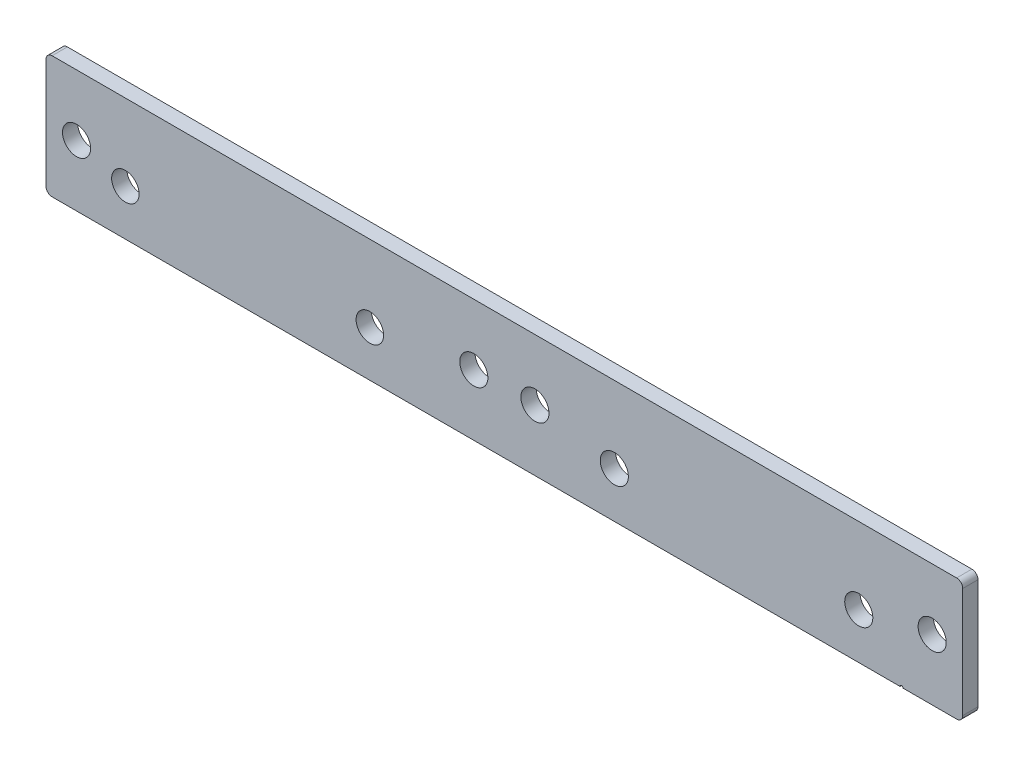
ISO-10303-21;
HEADER;
FILE_DESCRIPTION(('STEP AP214'),'2;1');
FILE_NAME('part.step','',(''),(''),'','','');
FILE_SCHEMA(('AUTOMOTIVE_DESIGN { 1 0 10303 214 1 1 1 1 }'));
ENDSEC;
DATA;
#1=APPLICATION_CONTEXT('core data for automotive mechanical design processes');
#2=APPLICATION_PROTOCOL_DEFINITION('international standard','automotive_design',2000,#1);
#3=PRODUCT_CONTEXT('',#1,'mechanical');
#4=PRODUCT('Part','Part','',(#3));
#5=PRODUCT_RELATED_PRODUCT_CATEGORY('part','',(#4));
#6=PRODUCT_DEFINITION_FORMATION('','',#4);
#7=PRODUCT_DEFINITION_CONTEXT('part definition',#1,'design');
#8=PRODUCT_DEFINITION('design','',#6,#7);
#9=PRODUCT_DEFINITION_SHAPE('','',#8);
#10=(LENGTH_UNIT() NAMED_UNIT(*) SI_UNIT(.MILLI.,.METRE.));
#11=(NAMED_UNIT(*) PLANE_ANGLE_UNIT() SI_UNIT($,.RADIAN.));
#12=(NAMED_UNIT(*) SI_UNIT($,.STERADIAN.) SOLID_ANGLE_UNIT());
#13=UNCERTAINTY_MEASURE_WITH_UNIT(LENGTH_MEASURE(1.E-05),#10,'distance_accuracy_value','');
#14=(GEOMETRIC_REPRESENTATION_CONTEXT(3) GLOBAL_UNCERTAINTY_ASSIGNED_CONTEXT((#13)) GLOBAL_UNIT_ASSIGNED_CONTEXT((#10,
#11,#12)) REPRESENTATION_CONTEXT('',''));
#15=CARTESIAN_POINT('',(0.,0.,0.));
#16=DIRECTION('',(0.,0.,1.));
#17=DIRECTION('',(1.,0.,0.));
#18=AXIS2_PLACEMENT_3D('',#15,#16,#17);
#19=CARTESIAN_POINT('',(-150.,-20.,5.));
#20=DIRECTION('',(0.,1.,0.));
#21=DIRECTION('',(-1.,0.,0.));
#22=AXIS2_PLACEMENT_3D('',#19,#20,#21);
#23=PLANE('',#22);
#24=DIRECTION('',(1.,0.,0.));
#25=VECTOR('',#24,1.);
#26=CARTESIAN_POINT('',(-150.,-20.,5.));
#27=LINE('',#26,#25);
#28=CARTESIAN_POINT('',(130.500000001088,-19.9999999999999,5.));
#29=VERTEX_POINT('',#28);
#30=CARTESIAN_POINT('',(148.,-19.9999999999999,5.));
#31=VERTEX_POINT('',#30);
#32=EDGE_CURVE('E117',#29,#31,#27,.T.);
#33=ORIENTED_EDGE('',*,*,#32,.F.);
#34=DIRECTION('',(0.,0.,-1.));
#35=VECTOR('',#34,1.);
#36=CARTESIAN_POINT('',(130.500000001088,-19.9999999999999,5.));
#37=LINE('',#36,#35);
#38=CARTESIAN_POINT('',(130.500000001088,-19.9999999999999,0.));
#39=VERTEX_POINT('',#38);
#40=EDGE_CURVE('E95',#29,#39,#37,.T.);
#41=ORIENTED_EDGE('',*,*,#40,.T.);
#42=DIRECTION('',(1.,0.,0.));
#43=VECTOR('',#42,1.);
#44=CARTESIAN_POINT('',(-150.,-20.,0.));
#45=LINE('',#44,#43);
#46=CARTESIAN_POINT('',(148.,-19.9999999999999,0.));
#47=VERTEX_POINT('',#46);
#48=EDGE_CURVE('E131',#39,#47,#45,.T.);
#49=ORIENTED_EDGE('',*,*,#48,.T.);
#50=DIRECTION('',(0.,0.,-1.));
#51=VECTOR('',#50,1.);
#52=CARTESIAN_POINT('',(148.,-19.9999999999999,5.));
#53=LINE('',#52,#51);
#54=EDGE_CURVE('E154',#47,#31,#53,.F.);
#55=ORIENTED_EDGE('',*,*,#54,.T.);
#56=EDGE_LOOP('',(#33,#41,#49,#55));
#57=FACE_BOUND('',#56,.T.);
#58=ADVANCED_FACE('F16',(#57),#23,.F.);
#59=CARTESIAN_POINT('',(-150.,20.,5.));
#60=DIRECTION('',(1.,0.,0.));
#61=DIRECTION('',(0.,1.,0.));
#62=AXIS2_PLACEMENT_3D('',#59,#60,#61);
#63=PLANE('',#62);
#64=DIRECTION('',(0.,-1.,0.));
#65=VECTOR('',#64,1.);
#66=CARTESIAN_POINT('',(-150.,20.,0.));
#67=LINE('',#66,#65);
#68=CARTESIAN_POINT('',(-150.,18.,0.));
#69=VERTEX_POINT('',#68);
#70=CARTESIAN_POINT('',(-150.,-18.,0.));
#71=VERTEX_POINT('',#70);
#72=EDGE_CURVE('E128',#69,#71,#67,.T.);
#73=ORIENTED_EDGE('',*,*,#72,.T.);
#74=DIRECTION('',(0.,0.,-1.));
#75=VECTOR('',#74,1.);
#76=CARTESIAN_POINT('',(-150.,-18.,5.));
#77=LINE('',#76,#75);
#78=CARTESIAN_POINT('',(-150.,-18.,5.));
#79=VERTEX_POINT('',#78);
#80=EDGE_CURVE('E10',#71,#79,#77,.F.);
#81=ORIENTED_EDGE('',*,*,#80,.T.);
#82=DIRECTION('',(0.,-1.,0.));
#83=VECTOR('',#82,1.);
#84=CARTESIAN_POINT('',(-150.,20.,5.));
#85=LINE('',#84,#83);
#86=CARTESIAN_POINT('',(-150.,18.,5.));
#87=VERTEX_POINT('',#86);
#88=EDGE_CURVE('E122',#87,#79,#85,.T.);
#89=ORIENTED_EDGE('',*,*,#88,.F.);
#90=DIRECTION('',(0.,0.,-1.));
#91=VECTOR('',#90,1.);
#92=CARTESIAN_POINT('',(-150.,18.,5.));
#93=LINE('',#92,#91);
#94=EDGE_CURVE('E24',#87,#69,#93,.T.);
#95=ORIENTED_EDGE('',*,*,#94,.T.);
#96=EDGE_LOOP('',(#73,#81,#89,#95));
#97=FACE_BOUND('',#96,.T.);
#98=ADVANCED_FACE('F172',(#97),#63,.F.);
#99=CARTESIAN_POINT('',(-148.,-20.,0.));
#100=VERTEX_POINT('',#99);
#101=CARTESIAN_POINT('',(129.500000001088,-19.9999999999999,0.));
#102=VERTEX_POINT('',#101);
#103=EDGE_CURVE('E109',#100,#102,#45,.T.);
#104=ORIENTED_EDGE('',*,*,#103,.T.);
#105=DIRECTION('',(0.,0.,-1.));
#106=VECTOR('',#105,1.);
#107=CARTESIAN_POINT('',(129.500000001088,-19.9999999999999,5.));
#108=LINE('',#107,#106);
#109=CARTESIAN_POINT('',(129.500000001088,-19.9999999999999,5.));
#110=VERTEX_POINT('',#109);
#111=EDGE_CURVE('E31',#102,#110,#108,.F.);
#112=ORIENTED_EDGE('',*,*,#111,.T.);
#113=CARTESIAN_POINT('',(-148.,-20.,5.));
#114=VERTEX_POINT('',#113);
#115=EDGE_CURVE('E106',#114,#110,#27,.T.);
#116=ORIENTED_EDGE('',*,*,#115,.F.);
#117=DIRECTION('',(0.,0.,-1.));
#118=VECTOR('',#117,1.);
#119=CARTESIAN_POINT('',(-148.,-20.,5.));
#120=LINE('',#119,#118);
#121=EDGE_CURVE('E152',#114,#100,#120,.T.);
#122=ORIENTED_EDGE('',*,*,#121,.T.);
#123=EDGE_LOOP('',(#104,#112,#116,#122));
#124=FACE_BOUND('',#123,.T.);
#125=ADVANCED_FACE('F104',(#124),#23,.F.);
#126=CARTESIAN_POINT('',(150.,20.,5.));
#127=DIRECTION('',(-1.,0.,0.));
#128=DIRECTION('',(0.,0.,1.));
#129=AXIS2_PLACEMENT_3D('',#126,#127,#128);
#130=PLANE('',#129);
#131=DIRECTION('',(0.,1.,0.));
#132=VECTOR('',#131,1.);
#133=CARTESIAN_POINT('',(150.,20.,5.));
#134=LINE('',#133,#132);
#135=CARTESIAN_POINT('',(150.,-17.9999999999999,5.));
#136=VERTEX_POINT('',#135);
#137=CARTESIAN_POINT('',(150.,18.,5.));
#138=VERTEX_POINT('',#137);
#139=EDGE_CURVE('E116',#136,#138,#134,.T.);
#140=ORIENTED_EDGE('',*,*,#139,.F.);
#141=DIRECTION('',(0.,0.,-1.));
#142=VECTOR('',#141,1.);
#143=CARTESIAN_POINT('',(150.,-17.9999999999999,5.));
#144=LINE('',#143,#142);
#145=CARTESIAN_POINT('',(150.,-17.9999999999999,0.));
#146=VERTEX_POINT('',#145);
#147=EDGE_CURVE('E140',#136,#146,#144,.T.);
#148=ORIENTED_EDGE('',*,*,#147,.T.);
#149=DIRECTION('',(0.,1.,0.));
#150=VECTOR('',#149,1.);
#151=CARTESIAN_POINT('',(150.,20.,0.));
#152=LINE('',#151,#150);
#153=CARTESIAN_POINT('',(150.,18.,0.));
#154=VERTEX_POINT('',#153);
#155=EDGE_CURVE('E134',#146,#154,#152,.T.);
#156=ORIENTED_EDGE('',*,*,#155,.T.);
#157=DIRECTION('',(0.,0.,-1.));
#158=VECTOR('',#157,1.);
#159=CARTESIAN_POINT('',(150.,18.,5.));
#160=LINE('',#159,#158);
#161=EDGE_CURVE('E127',#154,#138,#160,.F.);
#162=ORIENTED_EDGE('',*,*,#161,.T.);
#163=EDGE_LOOP('',(#140,#148,#156,#162));
#164=FACE_BOUND('',#163,.T.);
#165=ADVANCED_FACE('F202',(#164),#130,.F.);
#166=CARTESIAN_POINT('',(-150.,20.,5.));
#167=DIRECTION('',(0.,-1.,0.));
#168=DIRECTION('',(1.,0.,0.));
#169=AXIS2_PLACEMENT_3D('',#166,#167,#168);
#170=PLANE('',#169);
#171=DIRECTION('',(-1.,0.,0.));
#172=VECTOR('',#171,1.);
#173=CARTESIAN_POINT('',(-150.,20.,5.));
#174=LINE('',#173,#172);
#175=CARTESIAN_POINT('',(148.,20.,5.));
#176=VERTEX_POINT('',#175);
#177=CARTESIAN_POINT('',(-148.,20.,5.));
#178=VERTEX_POINT('',#177);
#179=EDGE_CURVE('E120',#176,#178,#174,.T.);
#180=ORIENTED_EDGE('',*,*,#179,.F.);
#181=DIRECTION('',(0.,0.,-1.));
#182=VECTOR('',#181,1.);
#183=CARTESIAN_POINT('',(148.,20.,5.));
#184=LINE('',#183,#182);
#185=CARTESIAN_POINT('',(148.,20.,0.));
#186=VERTEX_POINT('',#185);
#187=EDGE_CURVE('E165',#176,#186,#184,.T.);
#188=ORIENTED_EDGE('',*,*,#187,.T.);
#189=DIRECTION('',(-1.,0.,0.));
#190=VECTOR('',#189,1.);
#191=CARTESIAN_POINT('',(-150.,20.,0.));
#192=LINE('',#191,#190);
#193=CARTESIAN_POINT('',(-148.,20.,0.));
#194=VERTEX_POINT('',#193);
#195=EDGE_CURVE('E137',#186,#194,#192,.T.);
#196=ORIENTED_EDGE('',*,*,#195,.T.);
#197=DIRECTION('',(0.,0.,-1.));
#198=VECTOR('',#197,1.);
#199=CARTESIAN_POINT('',(-148.,20.,5.));
#200=LINE('',#199,#198);
#201=EDGE_CURVE('E39',#194,#178,#200,.F.);
#202=ORIENTED_EDGE('',*,*,#201,.T.);
#203=EDGE_LOOP('',(#180,#188,#196,#202));
#204=FACE_BOUND('',#203,.T.);
#205=ADVANCED_FACE('F206',(#204),#170,.F.);
#206=CARTESIAN_POINT('',(0.,0.,5.));
#207=DIRECTION('',(0.,0.,1.));
#208=DIRECTION('',(1.,0.,0.));
#209=AXIS2_PLACEMENT_3D('',#206,#207,#208);
#210=PLANE('',#209);
#211=CARTESIAN_POINT('',(130.000000001088,-20.,5.));
#212=DIRECTION('',(0.,0.,-1.));
#213=DIRECTION('',(-1.,0.,0.));
#214=AXIS2_PLACEMENT_3D('',#211,#212,#213);
#215=CIRCLE('',#214,0.499999999999999);
#216=EDGE_CURVE('E92',#110,#29,#215,.T.);
#217=ORIENTED_EDGE('',*,*,#216,.T.);
#218=ORIENTED_EDGE('',*,*,#32,.T.);
#219=CARTESIAN_POINT('',(148.,-17.9999999999999,5.));
#220=DIRECTION('',(0.,0.,1.));
#221=DIRECTION('',(1.,0.,0.));
#222=AXIS2_PLACEMENT_3D('',#219,#220,#221);
#223=CIRCLE('',#222,2.);
#224=EDGE_CURVE('E162',#31,#136,#223,.T.);
#225=ORIENTED_EDGE('',*,*,#224,.T.);
#226=ORIENTED_EDGE('',*,*,#139,.T.);
#227=CARTESIAN_POINT('',(148.,18.,5.));
#228=DIRECTION('',(0.,0.,1.));
#229=DIRECTION('',(1.,0.,0.));
#230=AXIS2_PLACEMENT_3D('',#227,#228,#229);
#231=CIRCLE('',#230,2.);
#232=EDGE_CURVE('E160',#138,#176,#231,.T.);
#233=ORIENTED_EDGE('',*,*,#232,.T.);
#234=ORIENTED_EDGE('',*,*,#179,.T.);
#235=CARTESIAN_POINT('',(-148.,18.,5.));
#236=DIRECTION('',(0.,0.,1.));
#237=DIRECTION('',(1.,0.,0.));
#238=AXIS2_PLACEMENT_3D('',#235,#236,#237);
#239=CIRCLE('',#238,2.);
#240=EDGE_CURVE('E157',#178,#87,#239,.T.);
#241=ORIENTED_EDGE('',*,*,#240,.T.);
#242=ORIENTED_EDGE('',*,*,#88,.T.);
#243=CARTESIAN_POINT('',(-148.,-18.,5.));
#244=DIRECTION('',(0.,0.,1.));
#245=DIRECTION('',(1.,0.,0.));
#246=AXIS2_PLACEMENT_3D('',#243,#244,#245);
#247=CIRCLE('',#246,2.);
#248=EDGE_CURVE('E115',#79,#114,#247,.T.);
#249=ORIENTED_EDGE('',*,*,#248,.T.);
#250=ORIENTED_EDGE('',*,*,#115,.T.);
#251=EDGE_LOOP('',(#217,#218,#225,#226,#233,#234,#241,#242,#249,#250));
#252=FACE_BOUND('',#251,.T.);
#253=CARTESIAN_POINT('',(-9.99999999999995,0.,5.));
#254=DIRECTION('',(0.,0.,1.));
#255=DIRECTION('',(1.,0.,0.));
#256=AXIS2_PLACEMENT_3D('',#253,#254,#255);
#257=CIRCLE('',#256,4.6);
#258=CARTESIAN_POINT('',(-5.39999999999995,0.,5.));
#259=VERTEX_POINT('',#258);
#260=EDGE_CURVE('E387',#259,#259,#257,.T.);
#261=ORIENTED_EDGE('',*,*,#260,.F.);
#262=EDGE_LOOP('',(#261));
#263=FACE_BOUND('',#262,.T.);
#264=CARTESIAN_POINT('',(10.,0.,5.));
#265=DIRECTION('',(0.,0.,1.));
#266=DIRECTION('',(1.,0.,0.));
#267=AXIS2_PLACEMENT_3D('',#264,#265,#266);
#268=CIRCLE('',#267,4.6);
#269=CARTESIAN_POINT('',(14.6000000000001,0.,5.));
#270=VERTEX_POINT('',#269);
#271=EDGE_CURVE('E395',#270,#270,#268,.T.);
#272=ORIENTED_EDGE('',*,*,#271,.F.);
#273=EDGE_LOOP('',(#272));
#274=FACE_BOUND('',#273,.T.);
#275=CARTESIAN_POINT('',(140.,0.,5.));
#276=DIRECTION('',(0.,0.,1.));
#277=DIRECTION('',(1.,0.,0.));
#278=AXIS2_PLACEMENT_3D('',#275,#276,#277);
#279=CIRCLE('',#278,4.59999999999999);
#280=CARTESIAN_POINT('',(144.6,0.,5.));
#281=VERTEX_POINT('',#280);
#282=EDGE_CURVE('E380',#281,#281,#279,.T.);
#283=ORIENTED_EDGE('',*,*,#282,.F.);
#284=EDGE_LOOP('',(#283));
#285=FACE_BOUND('',#284,.T.);
#286=CARTESIAN_POINT('',(-140.,0.,5.));
#287=DIRECTION('',(0.,0.,1.));
#288=DIRECTION('',(1.,0.,0.));
#289=AXIS2_PLACEMENT_3D('',#286,#287,#288);
#290=CIRCLE('',#289,4.59999999999999);
#291=CARTESIAN_POINT('',(-135.4,0.,5.));
#292=VERTEX_POINT('',#291);
#293=EDGE_CURVE('E394',#292,#292,#290,.T.);
#294=ORIENTED_EDGE('',*,*,#293,.F.);
#295=EDGE_LOOP('',(#294));
#296=FACE_BOUND('',#295,.T.);
#297=CARTESIAN_POINT('',(-44.0192378853797,-5.00000000000004,5.));
#298=DIRECTION('',(0.,0.,-1.));
#299=DIRECTION('',(-1.,0.,0.));
#300=AXIS2_PLACEMENT_3D('',#297,#298,#299);
#301=CIRCLE('',#300,4.50000000121248);
#302=CARTESIAN_POINT('',(-48.5192378865922,-5.00000000000004,5.));
#303=VERTEX_POINT('',#302);
#304=EDGE_CURVE('E415',#303,#303,#301,.T.);
#305=ORIENTED_EDGE('',*,*,#304,.T.);
#306=EDGE_LOOP('',(#305));
#307=FACE_BOUND('',#306,.T.);
#308=CARTESIAN_POINT('',(115.98076211462,-5.00000000000004,5.));
#309=DIRECTION('',(0.,0.,-1.));
#310=DIRECTION('',(-1.,0.,0.));
#311=AXIS2_PLACEMENT_3D('',#308,#309,#310);
#312=CIRCLE('',#311,4.6);
#313=CARTESIAN_POINT('',(111.38076211462,-5.00000000000004,5.));
#314=VERTEX_POINT('',#313);
#315=EDGE_CURVE('E408',#314,#314,#312,.T.);
#316=ORIENTED_EDGE('',*,*,#315,.T.);
#317=EDGE_LOOP('',(#316));
#318=FACE_BOUND('',#317,.T.);
#319=CARTESIAN_POINT('',(35.9807621146203,-5.00000000000004,5.));
#320=DIRECTION('',(0.,0.,-1.));
#321=DIRECTION('',(-1.,0.,0.));
#322=AXIS2_PLACEMENT_3D('',#319,#320,#321);
#323=CIRCLE('',#322,4.6);
#324=CARTESIAN_POINT('',(31.3807621146203,-5.00000000000004,5.));
#325=VERTEX_POINT('',#324);
#326=EDGE_CURVE('E420',#325,#325,#323,.T.);
#327=ORIENTED_EDGE('',*,*,#326,.T.);
#328=EDGE_LOOP('',(#327));
#329=FACE_BOUND('',#328,.T.);
#330=CARTESIAN_POINT('',(-124.01923788538,-5.00000000000004,5.));
#331=DIRECTION('',(0.,0.,-1.));
#332=DIRECTION('',(-1.,0.,0.));
#333=AXIS2_PLACEMENT_3D('',#330,#331,#332);
#334=CIRCLE('',#333,4.50000000002167);
#335=CARTESIAN_POINT('',(-128.519237885401,-5.00000000000004,5.));
#336=VERTEX_POINT('',#335);
#337=EDGE_CURVE('E132',#336,#336,#334,.T.);
#338=ORIENTED_EDGE('',*,*,#337,.T.);
#339=EDGE_LOOP('',(#338));
#340=FACE_BOUND('',#339,.T.);
#341=ADVANCED_FACE('F111',(#252,#263,#274,#285,#296,#307,#318,#329,#340),#210,.T.);
#342=CARTESIAN_POINT('',(0.,0.,0.));
#343=DIRECTION('',(0.,0.,1.));
#344=DIRECTION('',(1.,0.,0.));
#345=AXIS2_PLACEMENT_3D('',#342,#343,#344);
#346=PLANE('',#345);
#347=CARTESIAN_POINT('',(-9.99999999999995,0.,0.));
#348=DIRECTION('',(0.,0.,1.));
#349=DIRECTION('',(1.,0.,0.));
#350=AXIS2_PLACEMENT_3D('',#347,#348,#349);
#351=CIRCLE('',#350,4.6);
#352=CARTESIAN_POINT('',(-5.39999999999995,0.,0.));
#353=VERTEX_POINT('',#352);
#354=EDGE_CURVE('E390',#353,#353,#351,.F.);
#355=ORIENTED_EDGE('',*,*,#354,.F.);
#356=EDGE_LOOP('',(#355));
#357=FACE_BOUND('',#356,.T.);
#358=CARTESIAN_POINT('',(10.,0.,0.));
#359=DIRECTION('',(0.,0.,1.));
#360=DIRECTION('',(1.,0.,0.));
#361=AXIS2_PLACEMENT_3D('',#358,#359,#360);
#362=CIRCLE('',#361,4.6);
#363=CARTESIAN_POINT('',(14.6000000000001,0.,0.));
#364=VERTEX_POINT('',#363);
#365=EDGE_CURVE('E391',#364,#364,#362,.F.);
#366=ORIENTED_EDGE('',*,*,#365,.F.);
#367=EDGE_LOOP('',(#366));
#368=FACE_BOUND('',#367,.T.);
#369=CARTESIAN_POINT('',(140.,0.,0.));
#370=DIRECTION('',(0.,0.,1.));
#371=DIRECTION('',(1.,0.,0.));
#372=AXIS2_PLACEMENT_3D('',#369,#370,#371);
#373=CIRCLE('',#372,4.59999999999999);
#374=CARTESIAN_POINT('',(144.6,0.,0.));
#375=VERTEX_POINT('',#374);
#376=EDGE_CURVE('E383',#375,#375,#373,.F.);
#377=ORIENTED_EDGE('',*,*,#376,.F.);
#378=EDGE_LOOP('',(#377));
#379=FACE_BOUND('',#378,.T.);
#380=CARTESIAN_POINT('',(-140.,0.,0.));
#381=DIRECTION('',(0.,0.,1.));
#382=DIRECTION('',(1.,0.,0.));
#383=AXIS2_PLACEMENT_3D('',#380,#381,#382);
#384=CIRCLE('',#383,4.59999999999999);
#385=CARTESIAN_POINT('',(-135.4,0.,0.));
#386=VERTEX_POINT('',#385);
#387=EDGE_CURVE('E404',#386,#386,#384,.F.);
#388=ORIENTED_EDGE('',*,*,#387,.F.);
#389=EDGE_LOOP('',(#388));
#390=FACE_BOUND('',#389,.T.);
#391=CARTESIAN_POINT('',(-44.0192378853797,-5.00000000000004,0.));
#392=DIRECTION('',(0.,0.,-1.));
#393=DIRECTION('',(-1.,0.,0.));
#394=AXIS2_PLACEMENT_3D('',#391,#392,#393);
#395=CIRCLE('',#394,4.50000000121248);
#396=CARTESIAN_POINT('',(-48.5192378865922,-5.00000000000004,0.));
#397=VERTEX_POINT('',#396);
#398=EDGE_CURVE('E407',#397,#397,#395,.T.);
#399=ORIENTED_EDGE('',*,*,#398,.F.);
#400=EDGE_LOOP('',(#399));
#401=FACE_BOUND('',#400,.T.);
#402=CARTESIAN_POINT('',(115.98076211462,-5.00000000000004,0.));
#403=DIRECTION('',(0.,0.,-1.));
#404=DIRECTION('',(-1.,0.,0.));
#405=AXIS2_PLACEMENT_3D('',#402,#403,#404);
#406=CIRCLE('',#405,4.6);
#407=CARTESIAN_POINT('',(111.38076211462,-5.00000000000004,0.));
#408=VERTEX_POINT('',#407);
#409=EDGE_CURVE('E412',#408,#408,#406,.T.);
#410=ORIENTED_EDGE('',*,*,#409,.F.);
#411=EDGE_LOOP('',(#410));
#412=FACE_BOUND('',#411,.T.);
#413=CARTESIAN_POINT('',(35.9807621146203,-5.00000000000004,0.));
#414=DIRECTION('',(0.,0.,-1.));
#415=DIRECTION('',(-1.,0.,0.));
#416=AXIS2_PLACEMENT_3D('',#413,#414,#415);
#417=CIRCLE('',#416,4.6);
#418=CARTESIAN_POINT('',(31.3807621146203,-5.00000000000004,0.));
#419=VERTEX_POINT('',#418);
#420=EDGE_CURVE('E411',#419,#419,#417,.T.);
#421=ORIENTED_EDGE('',*,*,#420,.F.);
#422=EDGE_LOOP('',(#421));
#423=FACE_BOUND('',#422,.T.);
#424=CARTESIAN_POINT('',(-124.01923788538,-5.00000000000004,0.));
#425=DIRECTION('',(0.,0.,-1.));
#426=DIRECTION('',(-1.,0.,0.));
#427=AXIS2_PLACEMENT_3D('',#424,#425,#426);
#428=CIRCLE('',#427,4.50000000002167);
#429=CARTESIAN_POINT('',(-128.519237885401,-5.00000000000004,0.));
#430=VERTEX_POINT('',#429);
#431=EDGE_CURVE('E423',#430,#430,#428,.T.);
#432=ORIENTED_EDGE('',*,*,#431,.F.);
#433=EDGE_LOOP('',(#432));
#434=FACE_BOUND('',#433,.T.);
#435=ORIENTED_EDGE('',*,*,#48,.F.);
#436=CARTESIAN_POINT('',(130.000000001088,-20.,0.));
#437=DIRECTION('',(0.,0.,-1.));
#438=DIRECTION('',(-1.,0.,0.));
#439=AXIS2_PLACEMENT_3D('',#436,#437,#438);
#440=CIRCLE('',#439,0.499999999999999);
#441=EDGE_CURVE('E99',#102,#39,#440,.T.);
#442=ORIENTED_EDGE('',*,*,#441,.F.);
#443=ORIENTED_EDGE('',*,*,#103,.F.);
#444=CARTESIAN_POINT('',(-148.,-18.,0.));
#445=DIRECTION('',(0.,0.,1.));
#446=DIRECTION('',(1.,0.,0.));
#447=AXIS2_PLACEMENT_3D('',#444,#445,#446);
#448=CIRCLE('',#447,2.);
#449=EDGE_CURVE('E145',#100,#71,#448,.F.);
#450=ORIENTED_EDGE('',*,*,#449,.T.);
#451=ORIENTED_EDGE('',*,*,#72,.F.);
#452=CARTESIAN_POINT('',(-148.,18.,0.));
#453=DIRECTION('',(0.,0.,1.));
#454=DIRECTION('',(1.,0.,0.));
#455=AXIS2_PLACEMENT_3D('',#452,#453,#454);
#456=CIRCLE('',#455,2.);
#457=EDGE_CURVE('E143',#69,#194,#456,.F.);
#458=ORIENTED_EDGE('',*,*,#457,.T.);
#459=ORIENTED_EDGE('',*,*,#195,.F.);
#460=CARTESIAN_POINT('',(148.,18.,0.));
#461=DIRECTION('',(0.,0.,1.));
#462=DIRECTION('',(1.,0.,0.));
#463=AXIS2_PLACEMENT_3D('',#460,#461,#462);
#464=CIRCLE('',#463,2.);
#465=EDGE_CURVE('E147',#186,#154,#464,.F.);
#466=ORIENTED_EDGE('',*,*,#465,.T.);
#467=ORIENTED_EDGE('',*,*,#155,.F.);
#468=CARTESIAN_POINT('',(148.,-17.9999999999999,0.));
#469=DIRECTION('',(0.,0.,1.));
#470=DIRECTION('',(1.,0.,0.));
#471=AXIS2_PLACEMENT_3D('',#468,#469,#470);
#472=CIRCLE('',#471,2.);
#473=EDGE_CURVE('E149',#146,#47,#472,.F.);
#474=ORIENTED_EDGE('',*,*,#473,.T.);
#475=EDGE_LOOP('',(#435,#442,#443,#450,#451,#458,#459,#466,#467,#474));
#476=FACE_BOUND('',#475,.T.);
#477=ADVANCED_FACE('F178',(#357,#368,#379,#390,#401,#412,#423,#434,#476),#346,.F.);
#478=CARTESIAN_POINT('',(-124.01923788538,-5.00000000000004,5.));
#479=DIRECTION('',(0.,0.,-1.));
#480=DIRECTION('',(-1.,0.,0.));
#481=AXIS2_PLACEMENT_3D('',#478,#479,#480);
#482=CYLINDRICAL_SURFACE('',#481,4.50000000002167);
#483=ORIENTED_EDGE('',*,*,#337,.F.);
#484=EDGE_LOOP('',(#483));
#485=FACE_BOUND('',#484,.T.);
#486=ORIENTED_EDGE('',*,*,#431,.T.);
#487=EDGE_LOOP('',(#486));
#488=FACE_BOUND('',#487,.T.);
#489=ADVANCED_FACE('F216',(#485,#488),#482,.F.);
#490=CARTESIAN_POINT('',(35.9807621146203,-5.00000000000004,5.));
#491=DIRECTION('',(0.,0.,-1.));
#492=DIRECTION('',(-1.,0.,0.));
#493=AXIS2_PLACEMENT_3D('',#490,#491,#492);
#494=CYLINDRICAL_SURFACE('',#493,4.6);
#495=ORIENTED_EDGE('',*,*,#326,.F.);
#496=EDGE_LOOP('',(#495));
#497=FACE_BOUND('',#496,.T.);
#498=ORIENTED_EDGE('',*,*,#420,.T.);
#499=EDGE_LOOP('',(#498));
#500=FACE_BOUND('',#499,.T.);
#501=ADVANCED_FACE('F222',(#497,#500),#494,.F.);
#502=CARTESIAN_POINT('',(115.98076211462,-5.00000000000004,5.));
#503=DIRECTION('',(0.,0.,-1.));
#504=DIRECTION('',(-1.,0.,0.));
#505=AXIS2_PLACEMENT_3D('',#502,#503,#504);
#506=CYLINDRICAL_SURFACE('',#505,4.6);
#507=ORIENTED_EDGE('',*,*,#315,.F.);
#508=EDGE_LOOP('',(#507));
#509=FACE_BOUND('',#508,.T.);
#510=ORIENTED_EDGE('',*,*,#409,.T.);
#511=EDGE_LOOP('',(#510));
#512=FACE_BOUND('',#511,.T.);
#513=ADVANCED_FACE('F226',(#509,#512),#506,.F.);
#514=CARTESIAN_POINT('',(-44.0192378853797,-5.00000000000004,5.));
#515=DIRECTION('',(0.,0.,-1.));
#516=DIRECTION('',(-1.,0.,0.));
#517=AXIS2_PLACEMENT_3D('',#514,#515,#516);
#518=CYLINDRICAL_SURFACE('',#517,4.50000000121248);
#519=ORIENTED_EDGE('',*,*,#304,.F.);
#520=EDGE_LOOP('',(#519));
#521=FACE_BOUND('',#520,.T.);
#522=ORIENTED_EDGE('',*,*,#398,.T.);
#523=EDGE_LOOP('',(#522));
#524=FACE_BOUND('',#523,.T.);
#525=ADVANCED_FACE('F228',(#521,#524),#518,.F.);
#526=CARTESIAN_POINT('',(148.,-17.9999999999999,5.));
#527=DIRECTION('',(0.,0.,-1.));
#528=DIRECTION('',(-1.,0.,0.));
#529=AXIS2_PLACEMENT_3D('',#526,#527,#528);
#530=CYLINDRICAL_SURFACE('',#529,2.);
#531=ORIENTED_EDGE('',*,*,#224,.F.);
#532=ORIENTED_EDGE('',*,*,#54,.F.);
#533=ORIENTED_EDGE('',*,*,#473,.F.);
#534=ORIENTED_EDGE('',*,*,#147,.F.);
#535=EDGE_LOOP('',(#531,#532,#533,#534));
#536=FACE_BOUND('',#535,.T.);
#537=ADVANCED_FACE('F231',(#536),#530,.T.);
#538=CARTESIAN_POINT('',(148.,18.,5.));
#539=DIRECTION('',(0.,0.,-1.));
#540=DIRECTION('',(-1.,0.,0.));
#541=AXIS2_PLACEMENT_3D('',#538,#539,#540);
#542=CYLINDRICAL_SURFACE('',#541,2.);
#543=ORIENTED_EDGE('',*,*,#232,.F.);
#544=ORIENTED_EDGE('',*,*,#161,.F.);
#545=ORIENTED_EDGE('',*,*,#465,.F.);
#546=ORIENTED_EDGE('',*,*,#187,.F.);
#547=EDGE_LOOP('',(#543,#544,#545,#546));
#548=FACE_BOUND('',#547,.T.);
#549=ADVANCED_FACE('F192',(#548),#542,.T.);
#550=CARTESIAN_POINT('',(-148.,-18.,5.));
#551=DIRECTION('',(0.,0.,-1.));
#552=DIRECTION('',(-1.,0.,0.));
#553=AXIS2_PLACEMENT_3D('',#550,#551,#552);
#554=CYLINDRICAL_SURFACE('',#553,2.);
#555=ORIENTED_EDGE('',*,*,#248,.F.);
#556=ORIENTED_EDGE('',*,*,#80,.F.);
#557=ORIENTED_EDGE('',*,*,#449,.F.);
#558=ORIENTED_EDGE('',*,*,#121,.F.);
#559=EDGE_LOOP('',(#555,#556,#557,#558));
#560=FACE_BOUND('',#559,.T.);
#561=ADVANCED_FACE('F181',(#560),#554,.T.);
#562=CARTESIAN_POINT('',(-148.,18.,5.));
#563=DIRECTION('',(0.,0.,-1.));
#564=DIRECTION('',(-1.,0.,0.));
#565=AXIS2_PLACEMENT_3D('',#562,#563,#564);
#566=CYLINDRICAL_SURFACE('',#565,2.);
#567=ORIENTED_EDGE('',*,*,#240,.F.);
#568=ORIENTED_EDGE('',*,*,#201,.F.);
#569=ORIENTED_EDGE('',*,*,#457,.F.);
#570=ORIENTED_EDGE('',*,*,#94,.F.);
#571=EDGE_LOOP('',(#567,#568,#569,#570));
#572=FACE_BOUND('',#571,.T.);
#573=ADVANCED_FACE('F18',(#572),#566,.T.);
#574=CARTESIAN_POINT('',(-140.,0.,-13.0107647738325));
#575=DIRECTION('',(0.,0.,1.));
#576=DIRECTION('',(1.,0.,0.));
#577=AXIS2_PLACEMENT_3D('',#574,#575,#576);
#578=CYLINDRICAL_SURFACE('',#577,4.59999999999999);
#579=ORIENTED_EDGE('',*,*,#387,.T.);
#580=EDGE_LOOP('',(#579));
#581=FACE_BOUND('',#580,.T.);
#582=ORIENTED_EDGE('',*,*,#293,.T.);
#583=EDGE_LOOP('',(#582));
#584=FACE_BOUND('',#583,.T.);
#585=ADVANCED_FACE('F183',(#581,#584),#578,.F.);
#586=CARTESIAN_POINT('',(140.,0.,-13.0107647738325));
#587=DIRECTION('',(0.,0.,1.));
#588=DIRECTION('',(1.,0.,0.));
#589=AXIS2_PLACEMENT_3D('',#586,#587,#588);
#590=CYLINDRICAL_SURFACE('',#589,4.59999999999999);
#591=ORIENTED_EDGE('',*,*,#376,.T.);
#592=EDGE_LOOP('',(#591));
#593=FACE_BOUND('',#592,.T.);
#594=ORIENTED_EDGE('',*,*,#282,.T.);
#595=EDGE_LOOP('',(#594));
#596=FACE_BOUND('',#595,.T.);
#597=ADVANCED_FACE('F189',(#593,#596),#590,.F.);
#598=CARTESIAN_POINT('',(10.,0.,-13.0107647738325));
#599=DIRECTION('',(0.,0.,1.));
#600=DIRECTION('',(1.,0.,0.));
#601=AXIS2_PLACEMENT_3D('',#598,#599,#600);
#602=CYLINDRICAL_SURFACE('',#601,4.6);
#603=ORIENTED_EDGE('',*,*,#365,.T.);
#604=EDGE_LOOP('',(#603));
#605=FACE_BOUND('',#604,.T.);
#606=ORIENTED_EDGE('',*,*,#271,.T.);
#607=EDGE_LOOP('',(#606));
#608=FACE_BOUND('',#607,.T.);
#609=ADVANCED_FACE('F238',(#605,#608),#602,.F.);
#610=CARTESIAN_POINT('',(-9.99999999999995,0.,-13.0107647738325));
#611=DIRECTION('',(0.,0.,1.));
#612=DIRECTION('',(1.,0.,0.));
#613=AXIS2_PLACEMENT_3D('',#610,#611,#612);
#614=CYLINDRICAL_SURFACE('',#613,4.6);
#615=ORIENTED_EDGE('',*,*,#354,.T.);
#616=EDGE_LOOP('',(#615));
#617=FACE_BOUND('',#616,.T.);
#618=ORIENTED_EDGE('',*,*,#260,.T.);
#619=EDGE_LOOP('',(#618));
#620=FACE_BOUND('',#619,.T.);
#621=ADVANCED_FACE('F242',(#617,#620),#614,.F.);
#622=CARTESIAN_POINT('',(130.000000001088,-20.,5.));
#623=DIRECTION('',(0.,0.,-1.));
#624=DIRECTION('',(-1.,0.,0.));
#625=AXIS2_PLACEMENT_3D('',#622,#623,#624);
#626=CYLINDRICAL_SURFACE('',#625,0.499999999999999);
#627=ORIENTED_EDGE('',*,*,#216,.F.);
#628=ORIENTED_EDGE('',*,*,#111,.F.);
#629=ORIENTED_EDGE('',*,*,#441,.T.);
#630=ORIENTED_EDGE('',*,*,#40,.F.);
#631=EDGE_LOOP('',(#627,#628,#629,#630));
#632=FACE_BOUND('',#631,.T.);
#633=ADVANCED_FACE('F93',(#632),#626,.F.);
#634=CLOSED_SHELL('',(#58,#98,#125,#165,#205,#341,#477,#489,#501,#513,#525,#537,#549,#561,#573,
#585,#597,#609,#621,#633));
#635=MANIFOLD_SOLID_BREP('B1',#634);
#636=ADVANCED_BREP_SHAPE_REPRESENTATION('',(#18,#635),#14);
#637=SHAPE_DEFINITION_REPRESENTATION(#9,#636);
ENDSEC;
END-ISO-10303-21;
